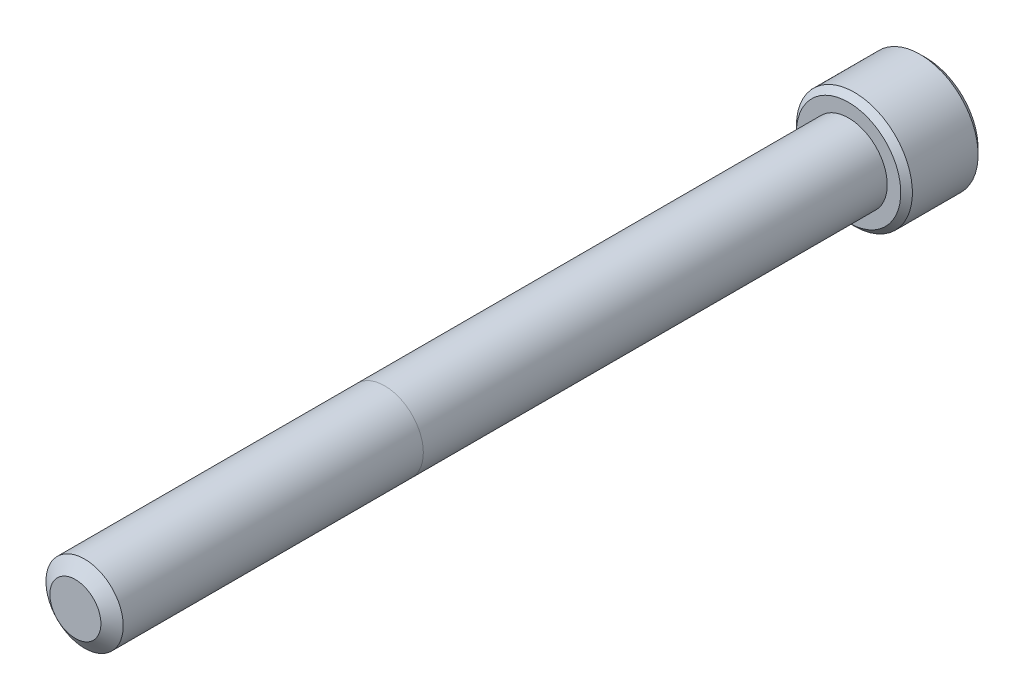
ISO-10303-21;
HEADER;
FILE_DESCRIPTION(('STEP AP214'),'2;1');
FILE_NAME('part.step','',(''),(''),'','','');
FILE_SCHEMA(('AUTOMOTIVE_DESIGN { 1 0 10303 214 1 1 1 1 }'));
ENDSEC;
DATA;
#1=APPLICATION_CONTEXT('core data for automotive mechanical design processes');
#2=APPLICATION_PROTOCOL_DEFINITION('international standard','automotive_design',2000,#1);
#3=PRODUCT_CONTEXT('',#1,'mechanical');
#4=PRODUCT('Part','Part','',(#3));
#5=PRODUCT_RELATED_PRODUCT_CATEGORY('part','',(#4));
#6=PRODUCT_DEFINITION_FORMATION('','',#4);
#7=PRODUCT_DEFINITION_CONTEXT('part definition',#1,'design');
#8=PRODUCT_DEFINITION('design','',#6,#7);
#9=PRODUCT_DEFINITION_SHAPE('','',#8);
#10=(LENGTH_UNIT() NAMED_UNIT(*) SI_UNIT(.MILLI.,.METRE.));
#11=(NAMED_UNIT(*) PLANE_ANGLE_UNIT() SI_UNIT($,.RADIAN.));
#12=(NAMED_UNIT(*) SI_UNIT($,.STERADIAN.) SOLID_ANGLE_UNIT());
#13=UNCERTAINTY_MEASURE_WITH_UNIT(LENGTH_MEASURE(1.E-05),#10,'distance_accuracy_value','');
#14=(GEOMETRIC_REPRESENTATION_CONTEXT(3) GLOBAL_UNCERTAINTY_ASSIGNED_CONTEXT((#13)) GLOBAL_UNIT_ASSIGNED_CONTEXT((#10,
#11,#12)) REPRESENTATION_CONTEXT('',''));
#15=CARTESIAN_POINT('',(0.,0.,0.));
#16=DIRECTION('',(0.,0.,1.));
#17=DIRECTION('',(1.,0.,0.));
#18=AXIS2_PLACEMENT_3D('',#15,#16,#17);
#19=CARTESIAN_POINT('',(0.,0.,-63.5));
#20=DIRECTION('',(0.,0.,1.));
#21=DIRECTION('',(1.,0.,0.));
#22=AXIS2_PLACEMENT_3D('',#19,#20,#21);
#23=CYLINDRICAL_SURFACE('',#22,3.175);
#24=CARTESIAN_POINT('',(0.,0.,-0.755446348705716));
#25=DIRECTION('',(0.,0.,1.));
#26=DIRECTION('',(1.,0.,0.));
#27=AXIS2_PLACEMENT_3D('',#24,#25,#26);
#28=CIRCLE('',#27,3.175);
#29=CARTESIAN_POINT('',(3.175,0.,-0.755446348705716));
#30=VERTEX_POINT('',#29);
#31=EDGE_CURVE('E113',#30,#30,#28,.T.);
#32=ORIENTED_EDGE('',*,*,#31,.F.);
#33=EDGE_LOOP('',(#32));
#34=FACE_BOUND('',#33,.T.);
#35=CARTESIAN_POINT('',(0.,0.,-25.4));
#36=DIRECTION('',(0.,0.,-1.));
#37=DIRECTION('',(-1.,0.,0.));
#38=AXIS2_PLACEMENT_3D('',#35,#36,#37);
#39=CIRCLE('',#38,3.175);
#40=CARTESIAN_POINT('',(3.175,0.,-25.4));
#41=VERTEX_POINT('',#40);
#42=CARTESIAN_POINT('',(-3.175,0.,-25.4));
#43=VERTEX_POINT('',#42);
#44=EDGE_CURVE('E40',#41,#43,#39,.F.);
#45=ORIENTED_EDGE('',*,*,#44,.T.);
#46=EDGE_CURVE('E11',#43,#41,#39,.F.);
#47=ORIENTED_EDGE('',*,*,#46,.T.);
#48=EDGE_LOOP('',(#45,#47));
#49=FACE_BOUND('',#48,.T.);
#50=ADVANCED_FACE('F36',(#34,#49),#23,.T.);
#51=ORIENTED_EDGE('',*,*,#46,.F.);
#52=ORIENTED_EDGE('',*,*,#44,.F.);
#53=EDGE_LOOP('',(#51,#52));
#54=FACE_BOUND('',#53,.T.);
#55=CARTESIAN_POINT('',(0.,0.,-63.5));
#56=DIRECTION('',(0.,0.,-1.));
#57=DIRECTION('',(-1.,0.,0.));
#58=AXIS2_PLACEMENT_3D('',#55,#56,#57);
#59=CIRCLE('',#58,3.175);
#60=CARTESIAN_POINT('',(-3.175,0.,-63.5));
#61=VERTEX_POINT('',#60);
#62=EDGE_CURVE('E197',#61,#61,#59,.F.);
#63=ORIENTED_EDGE('',*,*,#62,.T.);
#64=EDGE_LOOP('',(#63));
#65=FACE_BOUND('',#64,.T.);
#66=ADVANCED_FACE('F190',(#54,#65),#23,.T.);
#67=CARTESIAN_POINT('',(0.,0.,0.));
#68=DIRECTION('',(0.,0.,-1.));
#69=DIRECTION('',(-1.,0.,0.));
#70=AXIS2_PLACEMENT_3D('',#67,#68,#69);
#71=CONICAL_SURFACE('',#70,2.09611080289532,0.959931088596884);
#72=ORIENTED_EDGE('',*,*,#31,.T.);
#73=EDGE_LOOP('',(#72));
#74=FACE_BOUND('',#73,.T.);
#75=CARTESIAN_POINT('',(0.,0.,0.));
#76=DIRECTION('',(0.,0.,1.));
#77=DIRECTION('',(1.,0.,0.));
#78=AXIS2_PLACEMENT_3D('',#75,#76,#77);
#79=CIRCLE('',#78,2.09611080289532);
#80=CARTESIAN_POINT('',(2.09611080289532,0.,0.));
#81=VERTEX_POINT('',#80);
#82=EDGE_CURVE('E199',#81,#81,#79,.T.);
#83=ORIENTED_EDGE('',*,*,#82,.F.);
#84=EDGE_LOOP('',(#83));
#85=FACE_BOUND('',#84,.T.);
#86=ADVANCED_FACE('F193',(#74,#85),#71,.T.);
#87=CARTESIAN_POINT('',(0.,0.,0.));
#88=DIRECTION('',(0.,0.,1.));
#89=DIRECTION('',(1.,0.,0.));
#90=AXIS2_PLACEMENT_3D('',#87,#88,#89);
#91=PLANE('',#90);
#92=ORIENTED_EDGE('',*,*,#82,.T.);
#93=EDGE_LOOP('',(#92));
#94=FACE_BOUND('',#93,.T.);
#95=ADVANCED_FACE('F258',(#94),#91,.T.);
#96=CARTESIAN_POINT('',(0.,0.,-69.85));
#97=DIRECTION('',(0.,0.,1.));
#98=DIRECTION('',(1.,0.,0.));
#99=AXIS2_PLACEMENT_3D('',#96,#97,#98);
#100=CYLINDRICAL_SURFACE('',#99,4.7625);
#101=CARTESIAN_POINT('',(0.,0.,-69.37375));
#102=DIRECTION('',(0.,0.,-1.));
#103=DIRECTION('',(-1.,0.,0.));
#104=AXIS2_PLACEMENT_3D('',#101,#102,#103);
#105=CIRCLE('',#104,4.7625);
#106=CARTESIAN_POINT('',(-4.7625,0.,-69.37375));
#107=VERTEX_POINT('',#106);
#108=EDGE_CURVE('E181',#107,#107,#105,.F.);
#109=ORIENTED_EDGE('',*,*,#108,.T.);
#110=EDGE_LOOP('',(#109));
#111=FACE_BOUND('',#110,.T.);
#112=CARTESIAN_POINT('',(0.,0.,-63.97625));
#113=DIRECTION('',(0.,0.,-1.));
#114=DIRECTION('',(-1.,0.,0.));
#115=AXIS2_PLACEMENT_3D('',#112,#113,#114);
#116=CIRCLE('',#115,4.7625);
#117=CARTESIAN_POINT('',(-4.7625,0.,-63.97625));
#118=VERTEX_POINT('',#117);
#119=EDGE_CURVE('E178',#118,#118,#116,.T.);
#120=ORIENTED_EDGE('',*,*,#119,.T.);
#121=EDGE_LOOP('',(#120));
#122=FACE_BOUND('',#121,.T.);
#123=ADVANCED_FACE('F274',(#111,#122),#100,.T.);
#124=CARTESIAN_POINT('',(0.,0.,-69.85));
#125=DIRECTION('',(0.,0.,-1.));
#126=DIRECTION('',(-1.,0.,0.));
#127=AXIS2_PLACEMENT_3D('',#124,#125,#126);
#128=PLANE('',#127);
#129=CARTESIAN_POINT('',(0.,0.,-69.85));
#130=DIRECTION('',(0.,0.,-1.));
#131=DIRECTION('',(-1.,0.,0.));
#132=AXIS2_PLACEMENT_3D('',#129,#130,#131);
#133=CIRCLE('',#132,4.28624999999999);
#134=CARTESIAN_POINT('',(-4.28624999999999,0.,-69.85));
#135=VERTEX_POINT('',#134);
#136=EDGE_CURVE('E112',#135,#135,#133,.T.);
#137=ORIENTED_EDGE('',*,*,#136,.T.);
#138=EDGE_LOOP('',(#137));
#139=FACE_BOUND('',#138,.T.);
#140=CARTESIAN_POINT('',(0.,0.,-69.85));
#141=DIRECTION('',(0.,0.,-1.));
#142=DIRECTION('',(-1.,0.,0.));
#143=AXIS2_PLACEMENT_3D('',#140,#141,#142);
#144=CIRCLE('',#143,2.74963065701559);
#145=CARTESIAN_POINT('',(-2.38125,1.3748153285078,-69.85));
#146=VERTEX_POINT('',#145);
#147=CARTESIAN_POINT('',(0.,2.74963065701559,-69.85));
#148=VERTEX_POINT('',#147);
#149=EDGE_CURVE('E91',#146,#148,#144,.T.);
#150=ORIENTED_EDGE('',*,*,#149,.F.);
#151=CARTESIAN_POINT('',(-2.38125,-1.3748153285078,-69.85));
#152=VERTEX_POINT('',#151);
#153=EDGE_CURVE('E103',#152,#146,#144,.T.);
#154=ORIENTED_EDGE('',*,*,#153,.F.);
#155=CARTESIAN_POINT('',(0.,-2.74963065701559,-69.85));
#156=VERTEX_POINT('',#155);
#157=EDGE_CURVE('E437',#156,#152,#144,.T.);
#158=ORIENTED_EDGE('',*,*,#157,.F.);
#159=CARTESIAN_POINT('',(2.38125,-1.3748153285078,-69.85));
#160=VERTEX_POINT('',#159);
#161=EDGE_CURVE('E136',#160,#156,#144,.T.);
#162=ORIENTED_EDGE('',*,*,#161,.F.);
#163=CARTESIAN_POINT('',(2.38125,1.3748153285078,-69.85));
#164=VERTEX_POINT('',#163);
#165=EDGE_CURVE('E135',#164,#160,#144,.T.);
#166=ORIENTED_EDGE('',*,*,#165,.F.);
#167=EDGE_CURVE('E101',#148,#164,#144,.T.);
#168=ORIENTED_EDGE('',*,*,#167,.F.);
#169=EDGE_LOOP('',(#150,#154,#158,#162,#166,#168));
#170=FACE_BOUND('',#169,.T.);
#171=ADVANCED_FACE('F133',(#139,#170),#128,.T.);
#172=CARTESIAN_POINT('',(0.,0.,-63.5));
#173=DIRECTION('',(0.,0.,-1.));
#174=DIRECTION('',(-1.,0.,0.));
#175=AXIS2_PLACEMENT_3D('',#172,#173,#174);
#176=PLANE('',#175);
#177=CARTESIAN_POINT('',(0.,0.,-63.5));
#178=DIRECTION('',(0.,0.,-1.));
#179=DIRECTION('',(-1.,0.,0.));
#180=AXIS2_PLACEMENT_3D('',#177,#178,#179);
#181=CIRCLE('',#180,4.28625);
#182=CARTESIAN_POINT('',(-4.28625,0.,-63.5));
#183=VERTEX_POINT('',#182);
#184=EDGE_CURVE('E183',#183,#183,#181,.F.);
#185=ORIENTED_EDGE('',*,*,#184,.T.);
#186=EDGE_LOOP('',(#185));
#187=FACE_BOUND('',#186,.T.);
#188=ORIENTED_EDGE('',*,*,#62,.F.);
#189=EDGE_LOOP('',(#188));
#190=FACE_BOUND('',#189,.T.);
#191=ADVANCED_FACE('F273',(#187,#190),#176,.F.);
#192=CARTESIAN_POINT('',(0.,0.,-69.85));
#193=DIRECTION('',(0.,0.,-1.));
#194=DIRECTION('',(-1.,0.,0.));
#195=AXIS2_PLACEMENT_3D('',#192,#193,#194);
#196=CONICAL_SURFACE('',#195,2.74963065701559,0.78539816339745);
#197=ORIENTED_EDGE('',*,*,#167,.T.);
#198=CARTESIAN_POINT('',(-0.000200000000001419,2.74974612706943,-69.8501154773272));
#199=CARTESIAN_POINT('',(0.0816567823790486,2.70248609172789,-69.8028948967095));
#200=CARTESIAN_POINT('',(0.164882333771758,2.65443579722785,-69.7584475752929));
#201=CARTESIAN_POINT('',(0.334588480838037,2.556455907536,-69.6770654569856));
#202=CARTESIAN_POINT('',(0.4210852173531,2.50651699342501,-69.6401759430951));
#203=CARTESIAN_POINT('',(0.59550177400904,2.40581754748857,-69.5769834131659));
#204=CARTESIAN_POINT('',(0.683377171180673,2.35508266327639,-69.5505215587295));
#205=CARTESIAN_POINT('',(0.861062594070874,2.25249593653966,-69.509751515616));
#206=CARTESIAN_POINT('',(0.950867191185869,2.20064722822085,-69.4954128915305));
#207=CARTESIAN_POINT('',(1.10563960313034,2.11128933452158,-69.4824757847701));
#208=CARTESIAN_POINT('',(1.17040744896962,2.07389560129144,-69.4805606046532));
#209=CARTESIAN_POINT('',(1.29983727933557,1.99916925388849,-69.4837866227677));
#210=CARTESIAN_POINT('',(1.36449921879335,1.96183666573622,-69.4889302948571));
#211=CARTESIAN_POINT('',(1.4932125485774,1.88752399013711,-69.5059813108716));
#212=CARTESIAN_POINT('',(1.55726317423485,1.85054434417201,-69.5178962213493));
#213=CARTESIAN_POINT('',(1.68425683890527,1.77722451768916,-69.547835672352));
#214=CARTESIAN_POINT('',(1.74719996243582,1.74088428837517,-69.5658597445184));
#215=CARTESIAN_POINT('',(1.90842615073218,1.64780030516185,-69.6193688075524));
#216=CARTESIAN_POINT('',(2.00570949128784,1.59163374230437,-69.6588874208722));
#217=CARTESIAN_POINT('',(2.14875606262558,1.50904576583588,-69.7256003435508));
#218=CARTESIAN_POINT('',(2.19589628894397,1.48182934348129,-69.7490402091113));
#219=CARTESIAN_POINT('',(2.28930352636664,1.42790064981105,-69.7980566766595));
#220=CARTESIAN_POINT('',(2.33557105249683,1.40118808114505,-69.8236319667669));
#221=CARTESIAN_POINT('',(2.38145,1.37469985845396,-69.8501154773272));
#222=B_SPLINE_CURVE_WITH_KNOTS('',3,(#198,#199,#200,#201,#202,#203,#204,#205,#206,#207,#208,
#209,#210,#211,#212,#213,#214,#215,#216,#217,#218,#219,#220,#221),.UNSPECIFIED.,.F.,.F.,(4,2,2,
2,2,2,2,2,2,2,2,4),(0.,0.317196610611946,0.636241461041219,0.950218950629224,1.26340583824126,
1.48752413747844,1.71172100167747,1.93616888974082,2.16059957440837,2.51709639744764,
2.694861473691,2.87251813383155),.UNSPECIFIED.);
#223=EDGE_CURVE('E107',#148,#164,#222,.T.);
#224=ORIENTED_EDGE('',*,*,#223,.F.);
#225=EDGE_LOOP('',(#197,#224));
#226=FACE_BOUND('',#225,.T.);
#227=ADVANCED_FACE('F108',(#226),#196,.F.);
#228=ORIENTED_EDGE('',*,*,#165,.T.);
#229=CARTESIAN_POINT('',(2.38125,-2.7419429062928,-70.7319808948811));
#230=CARTESIAN_POINT('',(2.38125,-2.67517961094814,-70.6815846682677));
#231=CARTESIAN_POINT('',(2.38125,-2.60804251150403,-70.6316755878687));
#232=CARTESIAN_POINT('',(2.38125,-2.47287325090701,-70.5330498312406));
#233=CARTESIAN_POINT('',(2.38125,-2.40484086929573,-70.4843334574882));
#234=CARTESIAN_POINT('',(2.38125,-2.26723593537395,-70.3879648546737));
#235=CARTESIAN_POINT('',(2.38125,-2.1976555337683,-70.3403237956413));
#236=CARTESIAN_POINT('',(2.38125,-2.05731367870617,-70.2468199235723));
#237=CARTESIAN_POINT('',(2.38125,-1.98655230919793,-70.200956984903));
#238=CARTESIAN_POINT('',(2.38125,-1.83957751933871,-70.1088459008639));
#239=CARTESIAN_POINT('',(2.38125,-1.76328362015337,-70.0627255175311));
#240=CARTESIAN_POINT('',(2.38125,-1.60891357724903,-69.9735183040048));
#241=CARTESIAN_POINT('',(2.38125,-1.53083712168147,-69.930432010078));
#242=CARTESIAN_POINT('',(2.38125,-1.37291620350604,-69.8482265015513));
#243=CARTESIAN_POINT('',(2.38125,-1.29307799952833,-69.8090953579213));
#244=CARTESIAN_POINT('',(2.38125,-1.13121425104688,-69.7356679503644));
#245=CARTESIAN_POINT('',(2.38125,-1.04918943691786,-69.7013700954936));
#246=CARTESIAN_POINT('',(2.38125,-0.889535256852413,-69.6413546314484));
#247=CARTESIAN_POINT('',(2.38125,-0.812083865872972,-69.6151684784655));
#248=CARTESIAN_POINT('',(2.38125,-0.655316366649835,-69.5690097515196));
#249=CARTESIAN_POINT('',(2.38125,-0.576000130348889,-69.5490376056151));
#250=CARTESIAN_POINT('',(2.38125,-0.417295761724878,-69.5166821452753));
#251=CARTESIAN_POINT('',(2.38125,-0.337934577044903,-69.5041688083777));
#252=CARTESIAN_POINT('',(2.38125,-0.178363853149428,-69.4869738601797));
#253=CARTESIAN_POINT('',(2.38125,-0.0981544621508452,-69.4822909026206));
#254=CARTESIAN_POINT('',(2.38125,0.0594188032260134,-69.4811044408343));
#255=CARTESIAN_POINT('',(2.38125,0.13678058831205,-69.4843110104925));
#256=CARTESIAN_POINT('',(2.38125,0.290840960378524,-69.4980870567153));
#257=CARTESIAN_POINT('',(2.38125,0.367539482199551,-69.5086572485512));
#258=CARTESIAN_POINT('',(2.38125,0.521017492585624,-69.5367628297993));
#259=CARTESIAN_POINT('',(2.38125,0.597774958137444,-69.5544167488691));
#260=CARTESIAN_POINT('',(2.38125,0.749609813987385,-69.5957513961625));
#261=CARTESIAN_POINT('',(2.38125,0.824687344292223,-69.6194316201001));
#262=CARTESIAN_POINT('',(2.38125,1.06107814376439,-69.7028948628217));
#263=CARTESIAN_POINT('',(2.38125,1.21904786183135,-69.7721839268647));
#264=CARTESIAN_POINT('',(2.38125,1.4502100022134,-69.8876640836207));
#265=CARTESIAN_POINT('',(2.38125,1.52644290394183,-69.9281730569973));
#266=CARTESIAN_POINT('',(2.38125,1.6771761848505,-70.0123026889314));
#267=CARTESIAN_POINT('',(2.38125,1.75167687303396,-70.0559227867715));
#268=CARTESIAN_POINT('',(2.38125,1.89548152028664,-70.1434125561176));
#269=CARTESIAN_POINT('',(2.38125,1.96485959547429,-70.18716179235));
#270=CARTESIAN_POINT('',(2.38125,2.10242624345814,-70.2765011582982));
#271=CARTESIAN_POINT('',(2.38125,2.170614725594,-70.3220914274512));
#272=CARTESIAN_POINT('',(2.38125,2.30540317246408,-70.4144060045998));
#273=CARTESIAN_POINT('',(2.38125,2.37201154149387,-70.4611180923826));
#274=CARTESIAN_POINT('',(2.38125,2.50431799978025,-70.5557775774644));
#275=CARTESIAN_POINT('',(2.38125,2.57001633432536,-70.6037246315223));
#276=CARTESIAN_POINT('',(2.38125,2.63533378775872,-70.6521767329484));
#277=B_SPLINE_CURVE_WITH_KNOTS('',3,(#229,#230,#231,#232,#233,#234,#235,#236,#237,#238,#239,
#240,#241,#242,#243,#244,#245,#246,#247,#248,#249,#250,#251,#252,#253,#254,#255,#256,#257,#258,
#259,#260,#261,#262,#263,#264,#265,#266,#267,#268,#269,#270,#271,#272,#273,#274,#275,#276),
.UNSPECIFIED.,.F.,.F.,(4,2,2,2,2,2,2,2,2,2,2,2,2,2,2,2,2,2,2,2,2,2,2,4),(0.,0.25095128405775,
0.50196556492343,0.754924776117824,1.00786608183831,1.2752620782364,1.54270521810291,
1.80931602064962,2.07583885853551,2.32089852628727,2.56597507150036,2.80664400340548,
3.04727155341464,3.27918940999225,3.51112979724108,3.74712477430215,3.98310000960232,
4.49898139186045,4.75794323923239,5.01685853131883,5.2628895998971,5.50893933760934,
5.75299038355427,5.9969743157828),.UNSPECIFIED.);
#278=EDGE_CURVE('E100',#164,#160,#277,.F.);
#279=ORIENTED_EDGE('',*,*,#278,.F.);
#280=EDGE_LOOP('',(#228,#279));
#281=FACE_BOUND('',#280,.T.);
#282=ADVANCED_FACE('F374',(#281),#196,.F.);
#283=ORIENTED_EDGE('',*,*,#161,.T.);
#284=CARTESIAN_POINT('',(2.38145,-1.37469985845396,-69.8501154773272));
#285=CARTESIAN_POINT('',(2.29959321762095,-1.4219598937955,-69.8028948967095));
#286=CARTESIAN_POINT('',(2.21636766622824,-1.47001018829553,-69.7584475752929));
#287=CARTESIAN_POINT('',(2.04666151916196,-1.56799007798739,-69.6770654569856));
#288=CARTESIAN_POINT('',(1.9601647826469,-1.61792899209838,-69.6401759430951));
#289=CARTESIAN_POINT('',(1.78574822599096,-1.71862843803482,-69.5769834131659));
#290=CARTESIAN_POINT('',(1.69787282881932,-1.769363322247,-69.5505215587295));
#291=CARTESIAN_POINT('',(1.52018740592912,-1.87195004898374,-69.509751515616));
#292=CARTESIAN_POINT('',(1.43038280881413,-1.92379875730254,-69.4954128915305));
#293=CARTESIAN_POINT('',(1.27561039686966,-2.01315665100181,-69.4824757847701));
#294=CARTESIAN_POINT('',(1.21084255103038,-2.05055038423195,-69.4805606046532));
#295=CARTESIAN_POINT('',(1.08141272066442,-2.1252767316349,-69.4837866227677));
#296=CARTESIAN_POINT('',(1.01675078120664,-2.16260931978718,-69.4889302948571));
#297=CARTESIAN_POINT('',(0.888037451422598,-2.23692199538629,-69.5059813108716));
#298=CARTESIAN_POINT('',(0.82398682576514,-2.27390164135138,-69.5178962213493));
#299=CARTESIAN_POINT('',(0.696993161094721,-2.34722146783423,-69.547835672352));
#300=CARTESIAN_POINT('',(0.634050037564171,-2.38356169714823,-69.5658597445184));
#301=CARTESIAN_POINT('',(0.472823849267813,-2.47664568036155,-69.6193688075524));
#302=CARTESIAN_POINT('',(0.375540508712153,-2.53281224321902,-69.6588874208722));
#303=CARTESIAN_POINT('',(0.232493937374423,-2.61540021968751,-69.7256003435508));
#304=CARTESIAN_POINT('',(0.185353711056027,-2.6426166420421,-69.7490402091113));
#305=CARTESIAN_POINT('',(0.0919464736333546,-2.69654533571234,-69.7980566766595));
#306=CARTESIAN_POINT('',(0.0456789475031728,-2.72325790437834,-69.8236319667669));
#307=CARTESIAN_POINT('',(-0.000200000000005418,-2.74974612706943,-69.8501154773272));
#308=B_SPLINE_CURVE_WITH_KNOTS('',3,(#284,#285,#286,#287,#288,#289,#290,#291,#292,#293,#294,
#295,#296,#297,#298,#299,#300,#301,#302,#303,#304,#305,#306,#307),.UNSPECIFIED.,.F.,.F.,(4,2,2,
2,2,2,2,2,2,2,2,4),(0.,0.317196610611948,0.636241461041221,0.950218950629228,1.26340583824127,
1.48752413747845,1.71172100167748,1.93616888974083,2.16059957440837,2.51709639744764,
2.69486147369101,2.87251813383155),.UNSPECIFIED.);
#309=EDGE_CURVE('E146',#160,#156,#308,.T.);
#310=ORIENTED_EDGE('',*,*,#309,.F.);
#311=EDGE_LOOP('',(#283,#310));
#312=FACE_BOUND('',#311,.T.);
#313=ADVANCED_FACE('F366',(#312),#196,.F.);
#314=ORIENTED_EDGE('',*,*,#157,.T.);
#315=CARTESIAN_POINT('',(0.000200000000002581,-2.74974612706943,-69.8501154773272));
#316=CARTESIAN_POINT('',(-0.0816567823790475,-2.70248609172789,-69.8028948967095));
#317=CARTESIAN_POINT('',(-0.164882333771757,-2.65443579722785,-69.7584475752929));
#318=CARTESIAN_POINT('',(-0.334588480838038,-2.556455907536,-69.6770654569856));
#319=CARTESIAN_POINT('',(-0.421085217353102,-2.50651699342501,-69.6401759430951));
#320=CARTESIAN_POINT('',(-0.595501774009044,-2.40581754748857,-69.5769834131659));
#321=CARTESIAN_POINT('',(-0.683377171180678,-2.35508266327638,-69.5505215587295));
#322=CARTESIAN_POINT('',(-0.861062594070882,-2.25249593653965,-69.509751515616));
#323=CARTESIAN_POINT('',(-0.950867191185878,-2.20064722822084,-69.4954128915305));
#324=CARTESIAN_POINT('',(-1.10563960313035,-2.11128933452157,-69.4824757847701));
#325=CARTESIAN_POINT('',(-1.17040744896963,-2.07389560129144,-69.4805606046532));
#326=CARTESIAN_POINT('',(-1.29983727933558,-1.99916925388848,-69.4837866227677));
#327=CARTESIAN_POINT('',(-1.36449921879336,-1.96183666573621,-69.4889302948571));
#328=CARTESIAN_POINT('',(-1.49321254857741,-1.8875239901371,-69.5059813108716));
#329=CARTESIAN_POINT('',(-1.55726317423486,-1.850544344172,-69.5178962213493));
#330=CARTESIAN_POINT('',(-1.68425683890528,-1.77722451768916,-69.547835672352));
#331=CARTESIAN_POINT('',(-1.74719996243583,-1.74088428837516,-69.5658597445184));
#332=CARTESIAN_POINT('',(-1.90842615073219,-1.64780030516184,-69.6193688075524));
#333=CARTESIAN_POINT('',(-2.00570949128785,-1.59163374230437,-69.6588874208722));
#334=CARTESIAN_POINT('',(-2.14875606262558,-1.50904576583588,-69.7256003435508));
#335=CARTESIAN_POINT('',(-2.19589628894397,-1.48182934348129,-69.7490402091113));
#336=CARTESIAN_POINT('',(-2.28930352636664,-1.42790064981105,-69.7980566766595));
#337=CARTESIAN_POINT('',(-2.33557105249683,-1.40118808114505,-69.8236319667669));
#338=CARTESIAN_POINT('',(-2.38145000000001,-1.37469985845396,-69.8501154773272));
#339=B_SPLINE_CURVE_WITH_KNOTS('',3,(#315,#316,#317,#318,#319,#320,#321,#322,#323,#324,#325,
#326,#327,#328,#329,#330,#331,#332,#333,#334,#335,#336,#337,#338),.UNSPECIFIED.,.F.,.F.,(4,2,2,
2,2,2,2,2,2,2,2,4),(0.,0.317196610611948,0.636241461041223,0.950218950629232,1.26340583824127,
1.48752413747846,1.71172100167748,1.93616888974084,2.16059957440838,2.51709639744764,
2.69486147369101,2.87251813383155),.UNSPECIFIED.);
#340=EDGE_CURVE('E235',#156,#152,#339,.T.);
#341=ORIENTED_EDGE('',*,*,#340,.F.);
#342=EDGE_LOOP('',(#314,#341));
#343=FACE_BOUND('',#342,.T.);
#344=ADVANCED_FACE('F358',(#343),#196,.F.);
#345=ORIENTED_EDGE('',*,*,#153,.T.);
#346=CARTESIAN_POINT('',(-2.38125,-2.74194290589387,-70.7319808945799));
#347=CARTESIAN_POINT('',(-2.38125,-2.6751796105604,-70.6815846679781));
#348=CARTESIAN_POINT('',(-2.38125,-2.60804251112752,-70.6316755875907));
#349=CARTESIAN_POINT('',(-2.38125,-2.47287325055307,-70.5330498309857));
#350=CARTESIAN_POINT('',(-2.38125,-2.40484086895312,-70.4843334572448));
#351=CARTESIAN_POINT('',(-2.38125,-2.2672359350544,-70.3879648544534));
#352=CARTESIAN_POINT('',(-2.38125,-2.19765553346048,-70.3403237954326));
#353=CARTESIAN_POINT('',(-2.38125,-2.05731367842202,-70.2468199233866));
#354=CARTESIAN_POINT('',(-2.38125,-1.98655230892572,-70.2009569847287));
#355=CARTESIAN_POINT('',(-2.38125,-1.83957751909225,-70.1088459007133));
#356=CARTESIAN_POINT('',(-2.38125,-1.76328361992074,-70.0627255173928));
#357=CARTESIAN_POINT('',(-2.38125,-1.60891357704459,-69.9735183038905));
#358=CARTESIAN_POINT('',(-2.38125,-1.53083712149137,-69.9304320099754));
#359=CARTESIAN_POINT('',(-2.38125,-1.37291620334514,-69.8482265014712));
#360=CARTESIAN_POINT('',(-2.38125,-1.29307799938227,-69.8090953578519));
#361=CARTESIAN_POINT('',(-2.38125,-1.13121425093132,-69.7356679503151));
#362=CARTESIAN_POINT('',(-2.38125,-1.04918943681795,-69.7013700954537));
#363=CARTESIAN_POINT('',(-2.38125,-0.889535256759272,-69.6413546314156));
#364=CARTESIAN_POINT('',(-2.38125,-0.812083865770256,-69.615168478432));
#365=CARTESIAN_POINT('',(-2.38125,-0.655316366527658,-69.5690097514868));
#366=CARTESIAN_POINT('',(-2.38125,-0.576000130216826,-69.5490376055837));
#367=CARTESIAN_POINT('',(-2.38125,-0.417295761573369,-69.5166821452488));
#368=CARTESIAN_POINT('',(-2.38125,-0.33793457688384,-69.5041688083547));
#369=CARTESIAN_POINT('',(-2.38125,-0.178363852969576,-69.4869738601659));
#370=CARTESIAN_POINT('',(-2.38125,-0.0981544619617591,-69.4822909026126));
#371=CARTESIAN_POINT('',(-2.38125,0.0594188034321363,-69.4811044408392));
#372=CARTESIAN_POINT('',(-2.38125,0.136780588525999,-69.4843110105046));
#373=CARTESIAN_POINT('',(-2.38125,0.290840960607343,-69.4980870567428));
#374=CARTESIAN_POINT('',(-2.38125,0.367539482435413,-69.5086572485871));
#375=CARTESIAN_POINT('',(-2.38125,0.521017492835391,-69.5367628298525));
#376=CARTESIAN_POINT('',(-2.38125,0.59777495839405,-69.5544167489315));
#377=CARTESIAN_POINT('',(-2.38125,0.749609814257011,-69.5957513962434));
#378=CARTESIAN_POINT('',(-2.38125,0.824687344568029,-69.6194316201904));
#379=CARTESIAN_POINT('',(-2.38125,1.06107814410026,-69.702894862956));
#380=CARTESIAN_POINT('',(-2.38125,1.2190478622181,-69.7721839270396));
#381=CARTESIAN_POINT('',(-2.38125,1.45021000267341,-69.8876640838597));
#382=CARTESIAN_POINT('',(-2.38125,1.52644290442585,-69.9281730572583));
#383=CARTESIAN_POINT('',(-2.38125,1.67717618538172,-70.0123026892371));
#384=CARTESIAN_POINT('',(-2.38125,1.7516768735884,-70.0559227870999));
#385=CARTESIAN_POINT('',(-2.38125,1.89548152088328,-70.143412556489));
#386=CARTESIAN_POINT('',(-2.38125,1.96485959608999,-70.1871617927418));
#387=CARTESIAN_POINT('',(-2.38125,2.1024262441117,-70.2765011587306));
#388=CARTESIAN_POINT('',(-2.38125,2.17061472626634,-70.3220914279041));
#389=CARTESIAN_POINT('',(-2.38125,2.30540317317355,-70.4144060050932));
#390=CARTESIAN_POINT('',(-2.38125,2.37201154222167,-70.4611180928962));
#391=CARTESIAN_POINT('',(-2.38125,2.50431800054459,-70.5557775780183));
#392=CARTESIAN_POINT('',(-2.38125,2.57001633510792,-70.6037246320963));
#393=CARTESIAN_POINT('',(-2.38125,2.63533378855947,-70.6521767335425));
#394=B_SPLINE_CURVE_WITH_KNOTS('',3,(#346,#347,#348,#349,#350,#351,#352,#353,#354,#355,#356,
#357,#358,#359,#360,#361,#362,#363,#364,#365,#366,#367,#368,#369,#370,#371,#372,#373,#374,#375,
#376,#377,#378,#379,#380,#381,#382,#383,#384,#385,#386,#387,#388,#389,#390,#391,#392,#393),
.UNSPECIFIED.,.F.,.F.,(4,2,2,2,2,2,2,2,2,2,2,2,2,2,2,2,2,2,2,2,2,2,2,4),(0.,0.250951284009995,
0.501965564827892,0.754924775973605,1.00786608164544,1.27526207798893,1.54270521780083,
1.8093160202934,2.0758388581252,2.32089852590464,2.56597507114537,2.80664400307699,
3.04727155311266,3.27918940971452,3.51112979698763,3.74712477407483,3.98310000940112,
4.49898139184705,4.75794323931355,5.01685853149448,5.26288960015362,5.50893933794674,
5.75299038397143,5.99697431627971),.UNSPECIFIED.);
#395=EDGE_CURVE('E123',#152,#146,#394,.T.);
#396=ORIENTED_EDGE('',*,*,#395,.F.);
#397=EDGE_LOOP('',(#345,#396));
#398=FACE_BOUND('',#397,.T.);
#399=ADVANCED_FACE('F350',(#398),#196,.F.);
#400=ORIENTED_EDGE('',*,*,#149,.T.);
#401=CARTESIAN_POINT('',(-2.38145,1.37469985845396,-69.8501154773272));
#402=CARTESIAN_POINT('',(-2.29959321762095,1.4219598937955,-69.8028948967095));
#403=CARTESIAN_POINT('',(-2.21636766622824,1.47001018829554,-69.7584475752929));
#404=CARTESIAN_POINT('',(-2.04666151916196,1.56799007798739,-69.6770654569856));
#405=CARTESIAN_POINT('',(-1.9601647826469,1.61792899209838,-69.6401759430951));
#406=CARTESIAN_POINT('',(-1.78574822599095,1.71862843803482,-69.5769834131659));
#407=CARTESIAN_POINT('',(-1.69787282881932,1.76936332224701,-69.5505215587295));
#408=CARTESIAN_POINT('',(-1.52018740592912,1.87195004898374,-69.509751515616));
#409=CARTESIAN_POINT('',(-1.43038280881412,1.92379875730255,-69.4954128915305));
#410=CARTESIAN_POINT('',(-1.27561039686965,2.01315665100181,-69.4824757847701));
#411=CARTESIAN_POINT('',(-1.21084255103037,2.05055038423195,-69.4805606046532));
#412=CARTESIAN_POINT('',(-1.08141272066442,2.12527673163491,-69.4837866227677));
#413=CARTESIAN_POINT('',(-1.01675078120664,2.16260931978718,-69.4889302948571));
#414=CARTESIAN_POINT('',(-0.888037451422593,2.23692199538629,-69.5059813108716));
#415=CARTESIAN_POINT('',(-0.823986825765135,2.27390164135139,-69.5178962213493));
#416=CARTESIAN_POINT('',(-0.696993161094715,2.34722146783423,-69.547835672352));
#417=CARTESIAN_POINT('',(-0.634050037564164,2.38356169714823,-69.5658597445184));
#418=CARTESIAN_POINT('',(-0.472823849267809,2.47664568036155,-69.6193688075524));
#419=CARTESIAN_POINT('',(-0.375540508712152,2.53281224321902,-69.6588874208722));
#420=CARTESIAN_POINT('',(-0.232493937374423,2.61540021968751,-69.7256003435508));
#421=CARTESIAN_POINT('',(-0.185353711056028,2.6426166420421,-69.7490402091113));
#422=CARTESIAN_POINT('',(-0.0919464736333542,2.69654533571234,-69.7980566766595));
#423=CARTESIAN_POINT('',(-0.0456789475031721,2.72325790437834,-69.8236319667669));
#424=CARTESIAN_POINT('',(0.000200000000006332,2.74974612706943,-69.8501154773272));
#425=B_SPLINE_CURVE_WITH_KNOTS('',3,(#401,#402,#403,#404,#405,#406,#407,#408,#409,#410,#411,
#412,#413,#414,#415,#416,#417,#418,#419,#420,#421,#422,#423,#424),.UNSPECIFIED.,.F.,.F.,(4,2,2,
2,2,2,2,2,2,2,2,4),(0.,0.317196610611948,0.636241461041224,0.950218950629232,1.26340583824127,
1.48752413747845,1.71172100167748,1.93616888974084,2.16059957440838,2.51709639744764,
2.69486147369101,2.87251813383155),.UNSPECIFIED.);
#426=EDGE_CURVE('E95',#146,#148,#425,.T.);
#427=ORIENTED_EDGE('',*,*,#426,.F.);
#428=EDGE_LOOP('',(#400,#427));
#429=FACE_BOUND('',#428,.T.);
#430=ADVANCED_FACE('F93',(#429),#196,.F.);
#431=CARTESIAN_POINT('',(2.38125,4.12444598552339,-66.278125));
#432=DIRECTION('',(0.,0.,-1.));
#433=DIRECTION('',(-1.,0.,0.));
#434=AXIS2_PLACEMENT_3D('',#431,#432,#433);
#435=PLANE('',#434);
#436=DIRECTION('',(0.866025403784439,0.5,0.));
#437=VECTOR('',#436,1.);
#438=CARTESIAN_POINT('',(-2.38125,1.3748153285078,-66.278125));
#439=LINE('',#438,#437);
#440=CARTESIAN_POINT('',(-2.38125,1.3748153285078,-66.278125));
#441=VERTEX_POINT('',#440);
#442=CARTESIAN_POINT('',(0.,2.74963065701559,-66.278125));
#443=VERTEX_POINT('',#442);
#444=EDGE_CURVE('E122',#441,#443,#439,.T.);
#445=ORIENTED_EDGE('',*,*,#444,.T.);
#446=DIRECTION('',(0.866025403784439,-0.5,0.));
#447=VECTOR('',#446,1.);
#448=CARTESIAN_POINT('',(0.,2.74963065701559,-66.278125));
#449=LINE('',#448,#447);
#450=CARTESIAN_POINT('',(2.38125,1.3748153285078,-66.278125));
#451=VERTEX_POINT('',#450);
#452=EDGE_CURVE('E127',#443,#451,#449,.T.);
#453=ORIENTED_EDGE('',*,*,#452,.T.);
#454=DIRECTION('',(0.,-1.,0.));
#455=VECTOR('',#454,1.);
#456=CARTESIAN_POINT('',(2.38125,1.3748153285078,-66.278125));
#457=LINE('',#456,#455);
#458=CARTESIAN_POINT('',(2.38125,-1.3748153285078,-66.278125));
#459=VERTEX_POINT('',#458);
#460=EDGE_CURVE('E221',#451,#459,#457,.T.);
#461=ORIENTED_EDGE('',*,*,#460,.T.);
#462=DIRECTION('',(-0.866025403784439,-0.5,0.));
#463=VECTOR('',#462,1.);
#464=CARTESIAN_POINT('',(2.38125,-1.3748153285078,-66.278125));
#465=LINE('',#464,#463);
#466=CARTESIAN_POINT('',(0.,-2.74963065701559,-66.278125));
#467=VERTEX_POINT('',#466);
#468=EDGE_CURVE('E218',#459,#467,#465,.T.);
#469=ORIENTED_EDGE('',*,*,#468,.T.);
#470=DIRECTION('',(-0.866025403784439,0.5,0.));
#471=VECTOR('',#470,1.);
#472=CARTESIAN_POINT('',(0.,-2.74963065701559,-66.278125));
#473=LINE('',#472,#471);
#474=CARTESIAN_POINT('',(-2.38125,-1.3748153285078,-66.278125));
#475=VERTEX_POINT('',#474);
#476=EDGE_CURVE('E215',#467,#475,#473,.T.);
#477=ORIENTED_EDGE('',*,*,#476,.T.);
#478=DIRECTION('',(0.,1.,0.));
#479=VECTOR('',#478,1.);
#480=CARTESIAN_POINT('',(-2.38125,-1.3748153285078,-66.278125));
#481=LINE('',#480,#479);
#482=EDGE_CURVE('E130',#475,#441,#481,.T.);
#483=ORIENTED_EDGE('',*,*,#482,.T.);
#484=EDGE_LOOP('',(#445,#453,#461,#469,#477,#483));
#485=FACE_BOUND('',#484,.T.);
#486=ADVANCED_FACE('F166',(#485),#435,.T.);
#487=CARTESIAN_POINT('',(0.,2.74963065701559,-66.278125));
#488=DIRECTION('',(0.5,0.866025403784439,0.));
#489=DIRECTION('',(-0.866025403784439,0.5,0.));
#490=AXIS2_PLACEMENT_3D('',#487,#488,#489);
#491=PLANE('',#490);
#492=DIRECTION('',(0.,0.,-1.));
#493=VECTOR('',#492,1.);
#494=CARTESIAN_POINT('',(0.,2.74963065701559,-66.278125));
#495=LINE('',#494,#493);
#496=EDGE_CURVE('E119',#443,#148,#495,.T.);
#497=ORIENTED_EDGE('',*,*,#496,.T.);
#498=ORIENTED_EDGE('',*,*,#223,.T.);
#499=DIRECTION('',(0.,0.,-1.));
#500=VECTOR('',#499,1.);
#501=CARTESIAN_POINT('',(2.38125,1.3748153285078,-66.278125));
#502=LINE('',#501,#500);
#503=EDGE_CURVE('E129',#451,#164,#502,.T.);
#504=ORIENTED_EDGE('',*,*,#503,.F.);
#505=ORIENTED_EDGE('',*,*,#452,.F.);
#506=EDGE_LOOP('',(#497,#498,#504,#505));
#507=FACE_BOUND('',#506,.T.);
#508=ADVANCED_FACE('F125',(#507),#491,.F.);
#509=CARTESIAN_POINT('',(2.38125,1.3748153285078,-66.278125));
#510=DIRECTION('',(1.,0.,0.));
#511=DIRECTION('',(0.,1.,0.));
#512=AXIS2_PLACEMENT_3D('',#509,#510,#511);
#513=PLANE('',#512);
#514=ORIENTED_EDGE('',*,*,#503,.T.);
#515=ORIENTED_EDGE('',*,*,#278,.T.);
#516=DIRECTION('',(0.,0.,-1.));
#517=VECTOR('',#516,1.);
#518=CARTESIAN_POINT('',(2.38125,-1.3748153285078,-66.278125));
#519=LINE('',#518,#517);
#520=EDGE_CURVE('E206',#459,#160,#519,.T.);
#521=ORIENTED_EDGE('',*,*,#520,.F.);
#522=ORIENTED_EDGE('',*,*,#460,.F.);
#523=EDGE_LOOP('',(#514,#515,#521,#522));
#524=FACE_BOUND('',#523,.T.);
#525=ADVANCED_FACE('F155',(#524),#513,.F.);
#526=CARTESIAN_POINT('',(2.38125,-1.3748153285078,-66.278125));
#527=DIRECTION('',(0.5,-0.866025403784439,0.));
#528=DIRECTION('',(0.866025403784439,0.5,0.));
#529=AXIS2_PLACEMENT_3D('',#526,#527,#528);
#530=PLANE('',#529);
#531=ORIENTED_EDGE('',*,*,#520,.T.);
#532=ORIENTED_EDGE('',*,*,#309,.T.);
#533=DIRECTION('',(0.,0.,-1.));
#534=VECTOR('',#533,1.);
#535=CARTESIAN_POINT('',(0.,-2.74963065701559,-66.278125));
#536=LINE('',#535,#534);
#537=EDGE_CURVE('E209',#467,#156,#536,.T.);
#538=ORIENTED_EDGE('',*,*,#537,.F.);
#539=ORIENTED_EDGE('',*,*,#468,.F.);
#540=EDGE_LOOP('',(#531,#532,#538,#539));
#541=FACE_BOUND('',#540,.T.);
#542=ADVANCED_FACE('F159',(#541),#530,.F.);
#543=CARTESIAN_POINT('',(0.,-2.74963065701559,-66.278125));
#544=DIRECTION('',(-0.5,-0.866025403784439,0.));
#545=DIRECTION('',(0.866025403784439,-0.5,0.));
#546=AXIS2_PLACEMENT_3D('',#543,#544,#545);
#547=PLANE('',#546);
#548=ORIENTED_EDGE('',*,*,#537,.T.);
#549=ORIENTED_EDGE('',*,*,#340,.T.);
#550=DIRECTION('',(0.,0.,-1.));
#551=VECTOR('',#550,1.);
#552=CARTESIAN_POINT('',(-2.38125,-1.3748153285078,-66.278125));
#553=LINE('',#552,#551);
#554=EDGE_CURVE('E202',#475,#152,#553,.T.);
#555=ORIENTED_EDGE('',*,*,#554,.F.);
#556=ORIENTED_EDGE('',*,*,#476,.F.);
#557=EDGE_LOOP('',(#548,#549,#555,#556));
#558=FACE_BOUND('',#557,.T.);
#559=ADVANCED_FACE('F243',(#558),#547,.F.);
#560=CARTESIAN_POINT('',(-2.38125,-1.3748153285078,-66.278125));
#561=DIRECTION('',(-1.,0.,0.));
#562=DIRECTION('',(0.,0.,1.));
#563=AXIS2_PLACEMENT_3D('',#560,#561,#562);
#564=PLANE('',#563);
#565=ORIENTED_EDGE('',*,*,#554,.T.);
#566=ORIENTED_EDGE('',*,*,#395,.T.);
#567=DIRECTION('',(0.,0.,-1.));
#568=VECTOR('',#567,1.);
#569=CARTESIAN_POINT('',(-2.38125,1.3748153285078,-66.278125));
#570=LINE('',#569,#568);
#571=EDGE_CURVE('E121',#441,#146,#570,.T.);
#572=ORIENTED_EDGE('',*,*,#571,.F.);
#573=ORIENTED_EDGE('',*,*,#482,.F.);
#574=EDGE_LOOP('',(#565,#566,#572,#573));
#575=FACE_BOUND('',#574,.T.);
#576=ADVANCED_FACE('F240',(#575),#564,.F.);
#577=CARTESIAN_POINT('',(-2.38125,1.3748153285078,-66.278125));
#578=DIRECTION('',(-0.5,0.866025403784439,0.));
#579=DIRECTION('',(-0.866025403784439,-0.5,0.));
#580=AXIS2_PLACEMENT_3D('',#577,#578,#579);
#581=PLANE('',#580);
#582=ORIENTED_EDGE('',*,*,#571,.T.);
#583=ORIENTED_EDGE('',*,*,#426,.T.);
#584=ORIENTED_EDGE('',*,*,#496,.F.);
#585=ORIENTED_EDGE('',*,*,#444,.F.);
#586=EDGE_LOOP('',(#582,#583,#584,#585));
#587=FACE_BOUND('',#586,.T.);
#588=ADVANCED_FACE('F117',(#587),#581,.F.);
#589=CARTESIAN_POINT('',(0.,0.,-69.85));
#590=DIRECTION('',(0.,0.,1.));
#591=DIRECTION('',(1.,0.,0.));
#592=AXIS2_PLACEMENT_3D('',#589,#590,#591);
#593=CONICAL_SURFACE('',#592,4.28624999999999,0.78539816339746);
#594=ORIENTED_EDGE('',*,*,#108,.F.);
#595=EDGE_LOOP('',(#594));
#596=FACE_BOUND('',#595,.T.);
#597=ORIENTED_EDGE('',*,*,#136,.F.);
#598=EDGE_LOOP('',(#597));
#599=FACE_BOUND('',#598,.T.);
#600=ADVANCED_FACE('F260',(#596,#599),#593,.T.);
#601=CARTESIAN_POINT('',(0.,0.,-63.97625));
#602=DIRECTION('',(0.,0.,-1.));
#603=DIRECTION('',(-1.,0.,0.));
#604=AXIS2_PLACEMENT_3D('',#601,#602,#603);
#605=CONICAL_SURFACE('',#604,4.7625,0.785398163397453);
#606=ORIENTED_EDGE('',*,*,#184,.F.);
#607=EDGE_LOOP('',(#606));
#608=FACE_BOUND('',#607,.T.);
#609=ORIENTED_EDGE('',*,*,#119,.F.);
#610=EDGE_LOOP('',(#609));
#611=FACE_BOUND('',#610,.T.);
#612=ADVANCED_FACE('F38',(#608,#611),#605,.T.);
#613=CLOSED_SHELL('',(#50,#66,#86,#95,#123,#171,#191,#227,#282,#313,#344,#399,#430,#486,#508,
#525,#542,#559,#576,#588,#600,#612));
#614=MANIFOLD_SOLID_BREP('B2',#613);
#615=ADVANCED_BREP_SHAPE_REPRESENTATION('',(#18,#614),#14);
#616=SHAPE_DEFINITION_REPRESENTATION(#9,#615);
ENDSEC;
END-ISO-10303-21;
